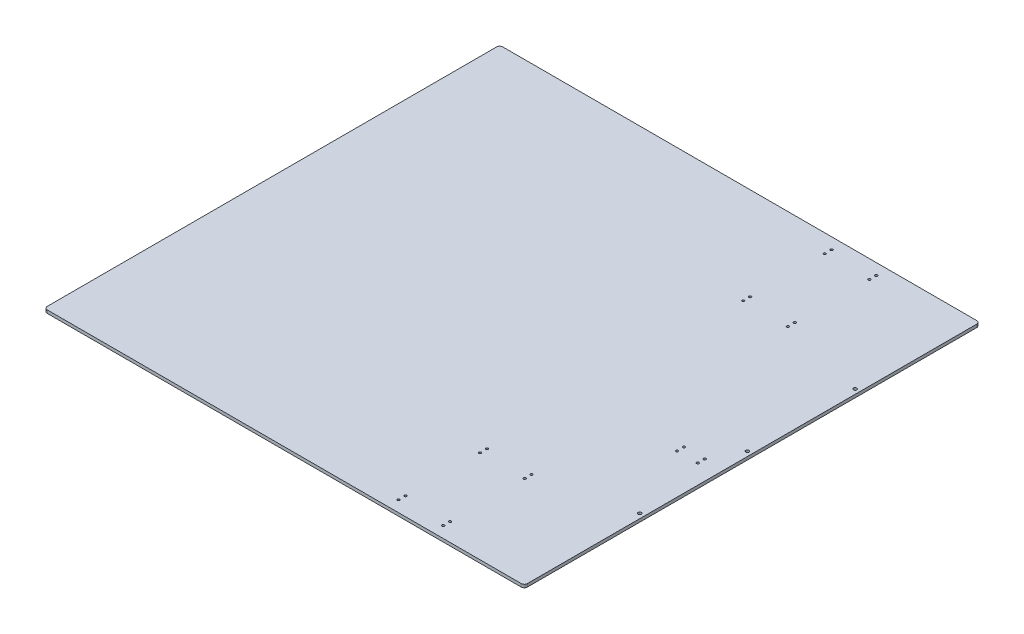
ISO-10303-21;
HEADER;
FILE_DESCRIPTION(('STEP AP214'),'2;1');
FILE_NAME('part.step','',(''),(''),'','','');
FILE_SCHEMA(('AUTOMOTIVE_DESIGN { 1 0 10303 214 1 1 1 1 }'));
ENDSEC;
DATA;
#1=APPLICATION_CONTEXT('core data for automotive mechanical design processes');
#2=APPLICATION_PROTOCOL_DEFINITION('international standard','automotive_design',2000,#1);
#3=PRODUCT_CONTEXT('',#1,'mechanical');
#4=PRODUCT('Part','Part','',(#3));
#5=PRODUCT_RELATED_PRODUCT_CATEGORY('part','',(#4));
#6=PRODUCT_DEFINITION_FORMATION('','',#4);
#7=PRODUCT_DEFINITION_CONTEXT('part definition',#1,'design');
#8=PRODUCT_DEFINITION('design','',#6,#7);
#9=PRODUCT_DEFINITION_SHAPE('','',#8);
#10=(LENGTH_UNIT() NAMED_UNIT(*) SI_UNIT(.MILLI.,.METRE.));
#11=(NAMED_UNIT(*) PLANE_ANGLE_UNIT() SI_UNIT($,.RADIAN.));
#12=(NAMED_UNIT(*) SI_UNIT($,.STERADIAN.) SOLID_ANGLE_UNIT());
#13=UNCERTAINTY_MEASURE_WITH_UNIT(LENGTH_MEASURE(1.E-05),#10,'distance_accuracy_value','');
#14=(GEOMETRIC_REPRESENTATION_CONTEXT(3) GLOBAL_UNCERTAINTY_ASSIGNED_CONTEXT((#13)) GLOBAL_UNIT_ASSIGNED_CONTEXT((#10,
#11,#12)) REPRESENTATION_CONTEXT('',''));
#15=CARTESIAN_POINT('',(0.,0.,0.));
#16=DIRECTION('',(0.,0.,1.));
#17=DIRECTION('',(1.,0.,0.));
#18=AXIS2_PLACEMENT_3D('',#15,#16,#17);
#19=CARTESIAN_POINT('',(0.,0.,469.9));
#20=DIRECTION('',(0.,1.,0.));
#21=DIRECTION('',(-1.,0.,0.));
#22=AXIS2_PLACEMENT_3D('',#19,#20,#21);
#23=PLANE('',#22);
#24=CARTESIAN_POINT('',(981.075000000002,0.,222.25));
#25=DIRECTION('',(0.,1.,0.));
#26=DIRECTION('',(0.,0.,1.));
#27=AXIS2_PLACEMENT_3D('',#24,#25,#26);
#28=CIRCLE('',#27,3.3654999999999);
#29=CARTESIAN_POINT('',(981.075000000002,0.,225.6155));
#30=VERTEX_POINT('',#29);
#31=EDGE_CURVE('E312',#30,#30,#28,.T.);
#32=ORIENTED_EDGE('',*,*,#31,.T.);
#33=EDGE_LOOP('',(#32));
#34=FACE_BOUND('',#33,.T.);
#35=CARTESIAN_POINT('',(981.074999999999,0.,-222.25));
#36=DIRECTION('',(0.,1.,0.));
#37=DIRECTION('',(0.,0.,1.));
#38=AXIS2_PLACEMENT_3D('',#35,#36,#37);
#39=CIRCLE('',#38,3.3654999999999);
#40=CARTESIAN_POINT('',(981.074999999999,0.,-218.8845));
#41=VERTEX_POINT('',#40);
#42=EDGE_CURVE('E307',#41,#41,#39,.T.);
#43=ORIENTED_EDGE('',*,*,#42,.T.);
#44=EDGE_LOOP('',(#43));
#45=FACE_BOUND('',#44,.T.);
#46=CARTESIAN_POINT('',(981.075,0.,0.));
#47=DIRECTION('',(0.,1.,0.));
#48=DIRECTION('',(0.,0.,1.));
#49=AXIS2_PLACEMENT_3D('',#46,#47,#48);
#50=CIRCLE('',#49,3.3654999999999);
#51=CARTESIAN_POINT('',(981.075,0.,3.3654999999999));
#52=VERTEX_POINT('',#51);
#53=EDGE_CURVE('E321',#52,#52,#50,.T.);
#54=ORIENTED_EDGE('',*,*,#53,.T.);
#55=EDGE_LOOP('',(#54));
#56=FACE_BOUND('',#55,.T.);
#57=CARTESIAN_POINT('',(708.025,0.,-264.414));
#58=DIRECTION('',(0.,-1.,0.));
#59=DIRECTION('',(0.,0.,-1.));
#60=AXIS2_PLACEMENT_3D('',#57,#58,#59);
#61=CIRCLE('',#60,2.4638);
#62=CARTESIAN_POINT('',(708.025,0.,-266.8778));
#63=VERTEX_POINT('',#62);
#64=EDGE_CURVE('E352',#63,#63,#61,.T.);
#65=ORIENTED_EDGE('',*,*,#64,.F.);
#66=EDGE_LOOP('',(#65));
#67=FACE_BOUND('',#66,.T.);
#68=CARTESIAN_POINT('',(800.1,0.,-432.562));
#69=DIRECTION('',(0.,-1.,0.));
#70=DIRECTION('',(0.,0.,-1.));
#71=AXIS2_PLACEMENT_3D('',#68,#69,#70);
#72=CIRCLE('',#71,2.4638);
#73=CARTESIAN_POINT('',(800.1,0.,-435.0258));
#74=VERTEX_POINT('',#73);
#75=EDGE_CURVE('E345',#74,#74,#72,.T.);
#76=ORIENTED_EDGE('',*,*,#75,.F.);
#77=EDGE_LOOP('',(#76));
#78=FACE_BOUND('',#77,.T.);
#79=CARTESIAN_POINT('',(708.025,0.,-432.562));
#80=DIRECTION('',(0.,-1.,0.));
#81=DIRECTION('',(0.,0.,-1.));
#82=AXIS2_PLACEMENT_3D('',#79,#80,#81);
#83=CIRCLE('',#82,2.4638);
#84=CARTESIAN_POINT('',(708.025,0.,-435.0258));
#85=VERTEX_POINT('',#84);
#86=EDGE_CURVE('E364',#85,#85,#83,.T.);
#87=ORIENTED_EDGE('',*,*,#86,.F.);
#88=EDGE_LOOP('',(#87));
#89=FACE_BOUND('',#88,.T.);
#90=CARTESIAN_POINT('',(708.025,0.,-446.786));
#91=DIRECTION('',(0.,-1.,0.));
#92=DIRECTION('',(0.,0.,-1.));
#93=AXIS2_PLACEMENT_3D('',#90,#91,#92);
#94=CIRCLE('',#93,2.4638);
#95=CARTESIAN_POINT('',(708.025,0.,-449.2498));
#96=VERTEX_POINT('',#95);
#97=EDGE_CURVE('E357',#96,#96,#94,.T.);
#98=ORIENTED_EDGE('',*,*,#97,.F.);
#99=EDGE_LOOP('',(#98));
#100=FACE_BOUND('',#99,.T.);
#101=CARTESIAN_POINT('',(800.1,0.,-278.638));
#102=DIRECTION('',(0.,-1.,0.));
#103=DIRECTION('',(0.,0.,-1.));
#104=AXIS2_PLACEMENT_3D('',#101,#102,#103);
#105=CIRCLE('',#104,2.4638);
#106=CARTESIAN_POINT('',(800.1,0.,-281.1018));
#107=VERTEX_POINT('',#106);
#108=EDGE_CURVE('E327',#107,#107,#105,.T.);
#109=ORIENTED_EDGE('',*,*,#108,.F.);
#110=EDGE_LOOP('',(#109));
#111=FACE_BOUND('',#110,.T.);
#112=CARTESIAN_POINT('',(800.1,0.,-264.414));
#113=DIRECTION('',(0.,-1.,0.));
#114=DIRECTION('',(0.,0.,-1.));
#115=AXIS2_PLACEMENT_3D('',#112,#113,#114);
#116=CIRCLE('',#115,2.4638);
#117=CARTESIAN_POINT('',(800.1,0.,-266.8778));
#118=VERTEX_POINT('',#117);
#119=EDGE_CURVE('E340',#118,#118,#116,.T.);
#120=ORIENTED_EDGE('',*,*,#119,.F.);
#121=EDGE_LOOP('',(#120));
#122=FACE_BOUND('',#121,.T.);
#123=CARTESIAN_POINT('',(708.025,0.,-278.638));
#124=DIRECTION('',(0.,-1.,0.));
#125=DIRECTION('',(0.,0.,-1.));
#126=AXIS2_PLACEMENT_3D('',#123,#124,#125);
#127=CIRCLE('',#126,2.4638);
#128=CARTESIAN_POINT('',(708.025,0.,-281.1018));
#129=VERTEX_POINT('',#128);
#130=EDGE_CURVE('E333',#129,#129,#127,.T.);
#131=ORIENTED_EDGE('',*,*,#130,.F.);
#132=EDGE_LOOP('',(#131));
#133=FACE_BOUND('',#132,.T.);
#134=CARTESIAN_POINT('',(800.1,0.,-446.786));
#135=DIRECTION('',(0.,-1.,0.));
#136=DIRECTION('',(0.,0.,-1.));
#137=AXIS2_PLACEMENT_3D('',#134,#135,#136);
#138=CIRCLE('',#137,2.4638);
#139=CARTESIAN_POINT('',(800.1,0.,-449.2498));
#140=VERTEX_POINT('',#139);
#141=EDGE_CURVE('E369',#140,#140,#138,.T.);
#142=ORIENTED_EDGE('',*,*,#141,.F.);
#143=EDGE_LOOP('',(#142));
#144=FACE_BOUND('',#143,.T.);
#145=CARTESIAN_POINT('',(708.025,0.,264.414));
#146=DIRECTION('',(0.,1.,0.));
#147=DIRECTION('',(0.,0.,1.));
#148=AXIS2_PLACEMENT_3D('',#145,#146,#147);
#149=CIRCLE('',#148,2.4638);
#150=CARTESIAN_POINT('',(708.025,0.,266.8778));
#151=VERTEX_POINT('',#150);
#152=EDGE_CURVE('E400',#151,#151,#149,.T.);
#153=ORIENTED_EDGE('',*,*,#152,.T.);
#154=EDGE_LOOP('',(#153));
#155=FACE_BOUND('',#154,.T.);
#156=CARTESIAN_POINT('',(800.1,0.,432.562));
#157=DIRECTION('',(0.,1.,0.));
#158=DIRECTION('',(0.,0.,1.));
#159=AXIS2_PLACEMENT_3D('',#156,#157,#158);
#160=CIRCLE('',#159,2.4638);
#161=CARTESIAN_POINT('',(800.1,0.,435.0258));
#162=VERTEX_POINT('',#161);
#163=EDGE_CURVE('E393',#162,#162,#160,.T.);
#164=ORIENTED_EDGE('',*,*,#163,.T.);
#165=EDGE_LOOP('',(#164));
#166=FACE_BOUND('',#165,.T.);
#167=CARTESIAN_POINT('',(708.025,0.,432.562));
#168=DIRECTION('',(0.,1.,0.));
#169=DIRECTION('',(0.,0.,1.));
#170=AXIS2_PLACEMENT_3D('',#167,#168,#169);
#171=CIRCLE('',#170,2.4638);
#172=CARTESIAN_POINT('',(708.025,0.,435.0258));
#173=VERTEX_POINT('',#172);
#174=EDGE_CURVE('E412',#173,#173,#171,.T.);
#175=ORIENTED_EDGE('',*,*,#174,.T.);
#176=EDGE_LOOP('',(#175));
#177=FACE_BOUND('',#176,.T.);
#178=CARTESIAN_POINT('',(708.025,0.,446.786));
#179=DIRECTION('',(0.,1.,0.));
#180=DIRECTION('',(0.,0.,1.));
#181=AXIS2_PLACEMENT_3D('',#178,#179,#180);
#182=CIRCLE('',#181,2.4638);
#183=CARTESIAN_POINT('',(708.025,0.,449.2498));
#184=VERTEX_POINT('',#183);
#185=EDGE_CURVE('E405',#184,#184,#182,.T.);
#186=ORIENTED_EDGE('',*,*,#185,.T.);
#187=EDGE_LOOP('',(#186));
#188=FACE_BOUND('',#187,.T.);
#189=CARTESIAN_POINT('',(800.1,0.,278.638));
#190=DIRECTION('',(0.,1.,0.));
#191=DIRECTION('',(0.,0.,1.));
#192=AXIS2_PLACEMENT_3D('',#189,#190,#191);
#193=CIRCLE('',#192,2.4638);
#194=CARTESIAN_POINT('',(800.1,0.,281.1018));
#195=VERTEX_POINT('',#194);
#196=EDGE_CURVE('E375',#195,#195,#193,.T.);
#197=ORIENTED_EDGE('',*,*,#196,.T.);
#198=EDGE_LOOP('',(#197));
#199=FACE_BOUND('',#198,.T.);
#200=CARTESIAN_POINT('',(800.1,0.,264.414));
#201=DIRECTION('',(0.,1.,0.));
#202=DIRECTION('',(0.,0.,1.));
#203=AXIS2_PLACEMENT_3D('',#200,#201,#202);
#204=CIRCLE('',#203,2.4638);
#205=CARTESIAN_POINT('',(800.1,0.,266.8778));
#206=VERTEX_POINT('',#205);
#207=EDGE_CURVE('E388',#206,#206,#204,.T.);
#208=ORIENTED_EDGE('',*,*,#207,.T.);
#209=EDGE_LOOP('',(#208));
#210=FACE_BOUND('',#209,.T.);
#211=CARTESIAN_POINT('',(708.025,0.,278.638));
#212=DIRECTION('',(0.,1.,0.));
#213=DIRECTION('',(0.,0.,1.));
#214=AXIS2_PLACEMENT_3D('',#211,#212,#213);
#215=CIRCLE('',#214,2.4638);
#216=CARTESIAN_POINT('',(708.025,0.,281.1018));
#217=VERTEX_POINT('',#216);
#218=EDGE_CURVE('E381',#217,#217,#215,.T.);
#219=ORIENTED_EDGE('',*,*,#218,.T.);
#220=EDGE_LOOP('',(#219));
#221=FACE_BOUND('',#220,.T.);
#222=CARTESIAN_POINT('',(800.1,0.,446.786));
#223=DIRECTION('',(0.,1.,0.));
#224=DIRECTION('',(0.,0.,1.));
#225=AXIS2_PLACEMENT_3D('',#222,#223,#224);
#226=CIRCLE('',#225,2.4638);
#227=CARTESIAN_POINT('',(800.1,0.,449.2498));
#228=VERTEX_POINT('',#227);
#229=EDGE_CURVE('E417',#228,#228,#226,.T.);
#230=ORIENTED_EDGE('',*,*,#229,.T.);
#231=EDGE_LOOP('',(#230));
#232=FACE_BOUND('',#231,.T.);
#233=CARTESIAN_POINT('',(908.05,0.,58.039));
#234=DIRECTION('',(0.,1.,0.));
#235=DIRECTION('',(0.,0.,1.));
#236=AXIS2_PLACEMENT_3D('',#233,#234,#235);
#237=CIRCLE('',#236,2.4638);
#238=CARTESIAN_POINT('',(908.05,0.,60.5028));
#239=VERTEX_POINT('',#238);
#240=EDGE_CURVE('E429',#239,#239,#237,.T.);
#241=ORIENTED_EDGE('',*,*,#240,.T.);
#242=EDGE_LOOP('',(#241));
#243=FACE_BOUND('',#242,.T.);
#244=CARTESIAN_POINT('',(950.976,0.,72.263));
#245=DIRECTION('',(0.,1.,0.));
#246=DIRECTION('',(0.,0.,1.));
#247=AXIS2_PLACEMENT_3D('',#244,#245,#246);
#248=CIRCLE('',#247,2.4638);
#249=CARTESIAN_POINT('',(950.976,0.,74.7268));
#250=VERTEX_POINT('',#249);
#251=EDGE_CURVE('E436',#250,#250,#248,.T.);
#252=ORIENTED_EDGE('',*,*,#251,.T.);
#253=EDGE_LOOP('',(#252));
#254=FACE_BOUND('',#253,.T.);
#255=CARTESIAN_POINT('',(950.976,0.,58.039));
#256=DIRECTION('',(0.,1.,0.));
#257=DIRECTION('',(0.,0.,1.));
#258=AXIS2_PLACEMENT_3D('',#255,#256,#257);
#259=CIRCLE('',#258,2.4638);
#260=CARTESIAN_POINT('',(950.976,0.,60.5028));
#261=VERTEX_POINT('',#260);
#262=EDGE_CURVE('E423',#261,#261,#259,.T.);
#263=ORIENTED_EDGE('',*,*,#262,.T.);
#264=EDGE_LOOP('',(#263));
#265=FACE_BOUND('',#264,.T.);
#266=CARTESIAN_POINT('',(908.05,0.,72.263));
#267=DIRECTION('',(0.,1.,0.));
#268=DIRECTION('',(0.,0.,1.));
#269=AXIS2_PLACEMENT_3D('',#266,#267,#268);
#270=CIRCLE('',#269,2.4638);
#271=CARTESIAN_POINT('',(908.05,0.,74.7268));
#272=VERTEX_POINT('',#271);
#273=EDGE_CURVE('E164',#272,#272,#270,.T.);
#274=ORIENTED_EDGE('',*,*,#273,.T.);
#275=EDGE_LOOP('',(#274));
#276=FACE_BOUND('',#275,.T.);
#277=DIRECTION('',(0.,0.,-1.));
#278=VECTOR('',#277,1.);
#279=CARTESIAN_POINT('',(0.,0.,469.9));
#280=LINE('',#279,#278);
#281=CARTESIAN_POINT('',(0.,0.,463.55));
#282=VERTEX_POINT('',#281);
#283=CARTESIAN_POINT('',(0.,0.,-463.55));
#284=VERTEX_POINT('',#283);
#285=EDGE_CURVE('E105',#282,#284,#280,.T.);
#286=ORIENTED_EDGE('',*,*,#285,.T.);
#287=CARTESIAN_POINT('',(6.35,0.,-463.55));
#288=DIRECTION('',(0.,1.,0.));
#289=DIRECTION('',(-1.,0.,0.));
#290=AXIS2_PLACEMENT_3D('',#287,#288,#289);
#291=CIRCLE('',#290,6.35);
#292=CARTESIAN_POINT('',(6.35,0.,-469.9));
#293=VERTEX_POINT('',#292);
#294=EDGE_CURVE('E138',#284,#293,#291,.F.);
#295=ORIENTED_EDGE('',*,*,#294,.T.);
#296=DIRECTION('',(1.,0.,0.));
#297=VECTOR('',#296,1.);
#298=CARTESIAN_POINT('',(0.,0.,-469.9));
#299=LINE('',#298,#297);
#300=CARTESIAN_POINT('',(984.25,0.,-469.9));
#301=VERTEX_POINT('',#300);
#302=EDGE_CURVE('E161',#293,#301,#299,.T.);
#303=ORIENTED_EDGE('',*,*,#302,.T.);
#304=CARTESIAN_POINT('',(984.25,0.,-463.55));
#305=DIRECTION('',(0.,1.,0.));
#306=DIRECTION('',(-1.,0.,0.));
#307=AXIS2_PLACEMENT_3D('',#304,#305,#306);
#308=CIRCLE('',#307,6.35);
#309=CARTESIAN_POINT('',(990.6,0.,-463.55));
#310=VERTEX_POINT('',#309);
#311=EDGE_CURVE('E136',#301,#310,#308,.F.);
#312=ORIENTED_EDGE('',*,*,#311,.T.);
#313=DIRECTION('',(0.,0.,-1.));
#314=VECTOR('',#313,1.);
#315=CARTESIAN_POINT('',(990.6,0.,469.9));
#316=LINE('',#315,#314);
#317=CARTESIAN_POINT('',(990.6,0.,463.55));
#318=VERTEX_POINT('',#317);
#319=EDGE_CURVE('E127',#318,#310,#316,.T.);
#320=ORIENTED_EDGE('',*,*,#319,.F.);
#321=CARTESIAN_POINT('',(984.25,0.,463.55));
#322=DIRECTION('',(0.,1.,0.));
#323=DIRECTION('',(-1.,0.,0.));
#324=AXIS2_PLACEMENT_3D('',#321,#322,#323);
#325=CIRCLE('',#324,6.35);
#326=CARTESIAN_POINT('',(984.25,0.,469.9));
#327=VERTEX_POINT('',#326);
#328=EDGE_CURVE('E112',#318,#327,#325,.F.);
#329=ORIENTED_EDGE('',*,*,#328,.T.);
#330=DIRECTION('',(1.,0.,0.));
#331=VECTOR('',#330,1.);
#332=CARTESIAN_POINT('',(0.,0.,469.9));
#333=LINE('',#332,#331);
#334=CARTESIAN_POINT('',(6.35,0.,469.9));
#335=VERTEX_POINT('',#334);
#336=EDGE_CURVE('E107',#335,#327,#333,.T.);
#337=ORIENTED_EDGE('',*,*,#336,.F.);
#338=CARTESIAN_POINT('',(6.35,0.,463.55));
#339=DIRECTION('',(0.,1.,0.));
#340=DIRECTION('',(-1.,0.,0.));
#341=AXIS2_PLACEMENT_3D('',#338,#339,#340);
#342=CIRCLE('',#341,6.35);
#343=EDGE_CURVE('E103',#335,#282,#342,.F.);
#344=ORIENTED_EDGE('',*,*,#343,.T.);
#345=EDGE_LOOP('',(#286,#295,#303,#312,#320,#329,#337,#344));
#346=FACE_BOUND('',#345,.T.);
#347=ADVANCED_FACE('F36',(#34,#45,#56,#67,#78,#89,#100,#111,#122,#133,#144,#155,#166,#177,#188,
#199,#210,#221,#232,#243,#254,#265,#276,#346),#23,.F.);
#348=CARTESIAN_POINT('',(990.6,0.,469.9));
#349=DIRECTION('',(-1.,0.,0.));
#350=DIRECTION('',(0.,0.,1.));
#351=AXIS2_PLACEMENT_3D('',#348,#349,#350);
#352=PLANE('',#351);
#353=ORIENTED_EDGE('',*,*,#319,.T.);
#354=DIRECTION('',(0.,1.,0.));
#355=VECTOR('',#354,1.);
#356=CARTESIAN_POINT('',(990.6,0.,-463.55));
#357=LINE('',#356,#355);
#358=CARTESIAN_POINT('',(990.6,6.35,-463.55));
#359=VERTEX_POINT('',#358);
#360=EDGE_CURVE('E151',#310,#359,#357,.T.);
#361=ORIENTED_EDGE('',*,*,#360,.T.);
#362=DIRECTION('',(0.,0.,-1.));
#363=VECTOR('',#362,1.);
#364=CARTESIAN_POINT('',(990.6,6.35,469.9));
#365=LINE('',#364,#363);
#366=CARTESIAN_POINT('',(990.6,6.35,463.55));
#367=VERTEX_POINT('',#366);
#368=EDGE_CURVE('E131',#367,#359,#365,.T.);
#369=ORIENTED_EDGE('',*,*,#368,.F.);
#370=DIRECTION('',(0.,1.,0.));
#371=VECTOR('',#370,1.);
#372=CARTESIAN_POINT('',(990.6,0.,463.55));
#373=LINE('',#372,#371);
#374=EDGE_CURVE('E149',#367,#318,#373,.F.);
#375=ORIENTED_EDGE('',*,*,#374,.T.);
#376=EDGE_LOOP('',(#353,#361,#369,#375));
#377=FACE_BOUND('',#376,.T.);
#378=ADVANCED_FACE('F171',(#377),#352,.F.);
#379=CARTESIAN_POINT('',(0.,6.34999999999997,469.9));
#380=DIRECTION('',(0.,-1.,0.));
#381=DIRECTION('',(1.,0.,0.));
#382=AXIS2_PLACEMENT_3D('',#379,#380,#381);
#383=PLANE('',#382);
#384=CARTESIAN_POINT('',(981.075000000002,6.34999999999997,222.25));
#385=DIRECTION('',(0.,1.,0.));
#386=DIRECTION('',(0.,0.,1.));
#387=AXIS2_PLACEMENT_3D('',#384,#385,#386);
#388=CIRCLE('',#387,3.3654999999999);
#389=CARTESIAN_POINT('',(981.075000000002,6.34999999999997,225.6155));
#390=VERTEX_POINT('',#389);
#391=EDGE_CURVE('E316',#390,#390,#388,.T.);
#392=ORIENTED_EDGE('',*,*,#391,.F.);
#393=EDGE_LOOP('',(#392));
#394=FACE_BOUND('',#393,.T.);
#395=CARTESIAN_POINT('',(981.074999999999,6.34999999999997,-222.25));
#396=DIRECTION('',(0.,1.,0.));
#397=DIRECTION('',(0.,0.,1.));
#398=AXIS2_PLACEMENT_3D('',#395,#396,#397);
#399=CIRCLE('',#398,3.3654999999999);
#400=CARTESIAN_POINT('',(981.074999999999,6.34999999999997,-218.8845));
#401=VERTEX_POINT('',#400);
#402=EDGE_CURVE('E310',#401,#401,#399,.T.);
#403=ORIENTED_EDGE('',*,*,#402,.F.);
#404=EDGE_LOOP('',(#403));
#405=FACE_BOUND('',#404,.T.);
#406=CARTESIAN_POINT('',(981.075,6.34999999999997,0.));
#407=DIRECTION('',(0.,1.,0.));
#408=DIRECTION('',(0.,0.,1.));
#409=AXIS2_PLACEMENT_3D('',#406,#407,#408);
#410=CIRCLE('',#409,3.3654999999999);
#411=CARTESIAN_POINT('',(981.075,6.34999999999997,3.3654999999999));
#412=VERTEX_POINT('',#411);
#413=EDGE_CURVE('E314',#412,#412,#410,.T.);
#414=ORIENTED_EDGE('',*,*,#413,.F.);
#415=EDGE_LOOP('',(#414));
#416=FACE_BOUND('',#415,.T.);
#417=CARTESIAN_POINT('',(708.025,6.34999999999997,-264.414));
#418=DIRECTION('',(0.,-1.,0.));
#419=DIRECTION('',(0.,0.,-1.));
#420=AXIS2_PLACEMENT_3D('',#417,#418,#419);
#421=CIRCLE('',#420,2.4638);
#422=CARTESIAN_POINT('',(708.025,6.34999999999997,-266.8778));
#423=VERTEX_POINT('',#422);
#424=EDGE_CURVE('E336',#423,#423,#421,.T.);
#425=ORIENTED_EDGE('',*,*,#424,.T.);
#426=EDGE_LOOP('',(#425));
#427=FACE_BOUND('',#426,.T.);
#428=CARTESIAN_POINT('',(800.1,6.34999999999997,-432.562));
#429=DIRECTION('',(0.,-1.,0.));
#430=DIRECTION('',(0.,0.,-1.));
#431=AXIS2_PLACEMENT_3D('',#428,#429,#430);
#432=CIRCLE('',#431,2.4638);
#433=CARTESIAN_POINT('',(800.1,6.34999999999997,-435.0258));
#434=VERTEX_POINT('',#433);
#435=EDGE_CURVE('E349',#434,#434,#432,.T.);
#436=ORIENTED_EDGE('',*,*,#435,.T.);
#437=EDGE_LOOP('',(#436));
#438=FACE_BOUND('',#437,.T.);
#439=CARTESIAN_POINT('',(708.025,6.34999999999997,-432.562));
#440=DIRECTION('',(0.,-1.,0.));
#441=DIRECTION('',(0.,0.,-1.));
#442=AXIS2_PLACEMENT_3D('',#439,#440,#441);
#443=CIRCLE('',#442,2.4638);
#444=CARTESIAN_POINT('',(708.025,6.34999999999997,-435.0258));
#445=VERTEX_POINT('',#444);
#446=EDGE_CURVE('E348',#445,#445,#443,.T.);
#447=ORIENTED_EDGE('',*,*,#446,.T.);
#448=EDGE_LOOP('',(#447));
#449=FACE_BOUND('',#448,.T.);
#450=CARTESIAN_POINT('',(708.025,6.34999999999997,-446.786));
#451=DIRECTION('',(0.,-1.,0.));
#452=DIRECTION('',(0.,0.,-1.));
#453=AXIS2_PLACEMENT_3D('',#450,#451,#452);
#454=CIRCLE('',#453,2.4638);
#455=CARTESIAN_POINT('',(708.025,6.34999999999997,-449.2498));
#456=VERTEX_POINT('',#455);
#457=EDGE_CURVE('E361',#456,#456,#454,.T.);
#458=ORIENTED_EDGE('',*,*,#457,.T.);
#459=EDGE_LOOP('',(#458));
#460=FACE_BOUND('',#459,.T.);
#461=CARTESIAN_POINT('',(800.1,6.34999999999997,-278.638));
#462=DIRECTION('',(0.,-1.,0.));
#463=DIRECTION('',(0.,0.,-1.));
#464=AXIS2_PLACEMENT_3D('',#461,#462,#463);
#465=CIRCLE('',#464,2.4638);
#466=CARTESIAN_POINT('',(800.1,6.34999999999997,-281.1018));
#467=VERTEX_POINT('',#466);
#468=EDGE_CURVE('E324',#467,#467,#465,.T.);
#469=ORIENTED_EDGE('',*,*,#468,.T.);
#470=EDGE_LOOP('',(#469));
#471=FACE_BOUND('',#470,.T.);
#472=CARTESIAN_POINT('',(800.1,6.34999999999997,-264.414));
#473=DIRECTION('',(0.,-1.,0.));
#474=DIRECTION('',(0.,0.,-1.));
#475=AXIS2_PLACEMENT_3D('',#472,#473,#474);
#476=CIRCLE('',#475,2.4638);
#477=CARTESIAN_POINT('',(800.1,6.34999999999997,-266.8778));
#478=VERTEX_POINT('',#477);
#479=EDGE_CURVE('E330',#478,#478,#476,.T.);
#480=ORIENTED_EDGE('',*,*,#479,.T.);
#481=EDGE_LOOP('',(#480));
#482=FACE_BOUND('',#481,.T.);
#483=CARTESIAN_POINT('',(708.025,6.34999999999997,-278.638));
#484=DIRECTION('',(0.,-1.,0.));
#485=DIRECTION('',(0.,0.,-1.));
#486=AXIS2_PLACEMENT_3D('',#483,#484,#485);
#487=CIRCLE('',#486,2.4638);
#488=CARTESIAN_POINT('',(708.025,6.34999999999997,-281.1018));
#489=VERTEX_POINT('',#488);
#490=EDGE_CURVE('E337',#489,#489,#487,.T.);
#491=ORIENTED_EDGE('',*,*,#490,.T.);
#492=EDGE_LOOP('',(#491));
#493=FACE_BOUND('',#492,.T.);
#494=CARTESIAN_POINT('',(800.1,6.34999999999997,-446.786));
#495=DIRECTION('',(0.,-1.,0.));
#496=DIRECTION('',(0.,0.,-1.));
#497=AXIS2_PLACEMENT_3D('',#494,#495,#496);
#498=CIRCLE('',#497,2.4638);
#499=CARTESIAN_POINT('',(800.1,6.34999999999997,-449.2498));
#500=VERTEX_POINT('',#499);
#501=EDGE_CURVE('E360',#500,#500,#498,.T.);
#502=ORIENTED_EDGE('',*,*,#501,.T.);
#503=EDGE_LOOP('',(#502));
#504=FACE_BOUND('',#503,.T.);
#505=CARTESIAN_POINT('',(708.025,6.34999999999997,264.414));
#506=DIRECTION('',(0.,1.,0.));
#507=DIRECTION('',(0.,0.,1.));
#508=AXIS2_PLACEMENT_3D('',#505,#506,#507);
#509=CIRCLE('',#508,2.4638);
#510=CARTESIAN_POINT('',(708.025,6.34999999999997,266.8778));
#511=VERTEX_POINT('',#510);
#512=EDGE_CURVE('E384',#511,#511,#509,.T.);
#513=ORIENTED_EDGE('',*,*,#512,.F.);
#514=EDGE_LOOP('',(#513));
#515=FACE_BOUND('',#514,.T.);
#516=CARTESIAN_POINT('',(800.1,6.34999999999997,432.562));
#517=DIRECTION('',(0.,1.,0.));
#518=DIRECTION('',(0.,0.,1.));
#519=AXIS2_PLACEMENT_3D('',#516,#517,#518);
#520=CIRCLE('',#519,2.4638);
#521=CARTESIAN_POINT('',(800.1,6.34999999999997,435.0258));
#522=VERTEX_POINT('',#521);
#523=EDGE_CURVE('E397',#522,#522,#520,.T.);
#524=ORIENTED_EDGE('',*,*,#523,.F.);
#525=EDGE_LOOP('',(#524));
#526=FACE_BOUND('',#525,.T.);
#527=CARTESIAN_POINT('',(708.025,6.34999999999997,432.562));
#528=DIRECTION('',(0.,1.,0.));
#529=DIRECTION('',(0.,0.,1.));
#530=AXIS2_PLACEMENT_3D('',#527,#528,#529);
#531=CIRCLE('',#530,2.4638);
#532=CARTESIAN_POINT('',(708.025,6.34999999999997,435.0258));
#533=VERTEX_POINT('',#532);
#534=EDGE_CURVE('E396',#533,#533,#531,.T.);
#535=ORIENTED_EDGE('',*,*,#534,.F.);
#536=EDGE_LOOP('',(#535));
#537=FACE_BOUND('',#536,.T.);
#538=CARTESIAN_POINT('',(708.025,6.34999999999997,446.786));
#539=DIRECTION('',(0.,1.,0.));
#540=DIRECTION('',(0.,0.,1.));
#541=AXIS2_PLACEMENT_3D('',#538,#539,#540);
#542=CIRCLE('',#541,2.4638);
#543=CARTESIAN_POINT('',(708.025,6.34999999999997,449.2498));
#544=VERTEX_POINT('',#543);
#545=EDGE_CURVE('E409',#544,#544,#542,.T.);
#546=ORIENTED_EDGE('',*,*,#545,.F.);
#547=EDGE_LOOP('',(#546));
#548=FACE_BOUND('',#547,.T.);
#549=CARTESIAN_POINT('',(800.1,6.34999999999997,278.638));
#550=DIRECTION('',(0.,1.,0.));
#551=DIRECTION('',(0.,0.,1.));
#552=AXIS2_PLACEMENT_3D('',#549,#550,#551);
#553=CIRCLE('',#552,2.4638);
#554=CARTESIAN_POINT('',(800.1,6.34999999999997,281.1018));
#555=VERTEX_POINT('',#554);
#556=EDGE_CURVE('E372',#555,#555,#553,.T.);
#557=ORIENTED_EDGE('',*,*,#556,.F.);
#558=EDGE_LOOP('',(#557));
#559=FACE_BOUND('',#558,.T.);
#560=CARTESIAN_POINT('',(800.1,6.34999999999997,264.414));
#561=DIRECTION('',(0.,1.,0.));
#562=DIRECTION('',(0.,0.,1.));
#563=AXIS2_PLACEMENT_3D('',#560,#561,#562);
#564=CIRCLE('',#563,2.4638);
#565=CARTESIAN_POINT('',(800.1,6.34999999999997,266.8778));
#566=VERTEX_POINT('',#565);
#567=EDGE_CURVE('E378',#566,#566,#564,.T.);
#568=ORIENTED_EDGE('',*,*,#567,.F.);
#569=EDGE_LOOP('',(#568));
#570=FACE_BOUND('',#569,.T.);
#571=CARTESIAN_POINT('',(708.025,6.34999999999997,278.638));
#572=DIRECTION('',(0.,1.,0.));
#573=DIRECTION('',(0.,0.,1.));
#574=AXIS2_PLACEMENT_3D('',#571,#572,#573);
#575=CIRCLE('',#574,2.4638);
#576=CARTESIAN_POINT('',(708.025,6.34999999999997,281.1018));
#577=VERTEX_POINT('',#576);
#578=EDGE_CURVE('E385',#577,#577,#575,.T.);
#579=ORIENTED_EDGE('',*,*,#578,.F.);
#580=EDGE_LOOP('',(#579));
#581=FACE_BOUND('',#580,.T.);
#582=CARTESIAN_POINT('',(800.1,6.34999999999997,446.786));
#583=DIRECTION('',(0.,1.,0.));
#584=DIRECTION('',(0.,0.,1.));
#585=AXIS2_PLACEMENT_3D('',#582,#583,#584);
#586=CIRCLE('',#585,2.4638);
#587=CARTESIAN_POINT('',(800.1,6.34999999999997,449.2498));
#588=VERTEX_POINT('',#587);
#589=EDGE_CURVE('E408',#588,#588,#586,.T.);
#590=ORIENTED_EDGE('',*,*,#589,.F.);
#591=EDGE_LOOP('',(#590));
#592=FACE_BOUND('',#591,.T.);
#593=CARTESIAN_POINT('',(908.05,6.34999999999997,58.039));
#594=DIRECTION('',(0.,1.,0.));
#595=DIRECTION('',(0.,0.,1.));
#596=AXIS2_PLACEMENT_3D('',#593,#594,#595);
#597=CIRCLE('',#596,2.4638);
#598=CARTESIAN_POINT('',(908.05,6.34999999999997,60.5028));
#599=VERTEX_POINT('',#598);
#600=EDGE_CURVE('E433',#599,#599,#597,.T.);
#601=ORIENTED_EDGE('',*,*,#600,.F.);
#602=EDGE_LOOP('',(#601));
#603=FACE_BOUND('',#602,.T.);
#604=CARTESIAN_POINT('',(950.976,6.34999999999997,72.263));
#605=DIRECTION('',(0.,1.,0.));
#606=DIRECTION('',(0.,0.,1.));
#607=AXIS2_PLACEMENT_3D('',#604,#605,#606);
#608=CIRCLE('',#607,2.4638);
#609=CARTESIAN_POINT('',(950.976,6.34999999999997,74.7268));
#610=VERTEX_POINT('',#609);
#611=EDGE_CURVE('E426',#610,#610,#608,.T.);
#612=ORIENTED_EDGE('',*,*,#611,.F.);
#613=EDGE_LOOP('',(#612));
#614=FACE_BOUND('',#613,.T.);
#615=CARTESIAN_POINT('',(950.976,6.34999999999997,58.039));
#616=DIRECTION('',(0.,1.,0.));
#617=DIRECTION('',(0.,0.,1.));
#618=AXIS2_PLACEMENT_3D('',#615,#616,#617);
#619=CIRCLE('',#618,2.4638);
#620=CARTESIAN_POINT('',(950.976,6.34999999999997,60.5028));
#621=VERTEX_POINT('',#620);
#622=EDGE_CURVE('E420',#621,#621,#619,.T.);
#623=ORIENTED_EDGE('',*,*,#622,.F.);
#624=EDGE_LOOP('',(#623));
#625=FACE_BOUND('',#624,.T.);
#626=CARTESIAN_POINT('',(908.05,6.34999999999997,72.263));
#627=DIRECTION('',(0.,1.,0.));
#628=DIRECTION('',(0.,0.,1.));
#629=AXIS2_PLACEMENT_3D('',#626,#627,#628);
#630=CIRCLE('',#629,2.4638);
#631=CARTESIAN_POINT('',(908.05,6.34999999999997,74.7268));
#632=VERTEX_POINT('',#631);
#633=EDGE_CURVE('E432',#632,#632,#630,.T.);
#634=ORIENTED_EDGE('',*,*,#633,.F.);
#635=EDGE_LOOP('',(#634));
#636=FACE_BOUND('',#635,.T.);
#637=DIRECTION('',(-1.,0.,0.));
#638=VECTOR('',#637,1.);
#639=CARTESIAN_POINT('',(0.,6.34999999999997,-469.9));
#640=LINE('',#639,#638);
#641=CARTESIAN_POINT('',(984.25,6.35,-469.9));
#642=VERTEX_POINT('',#641);
#643=CARTESIAN_POINT('',(6.35,6.34999999999997,-469.9));
#644=VERTEX_POINT('',#643);
#645=EDGE_CURVE('E157',#642,#644,#640,.T.);
#646=ORIENTED_EDGE('',*,*,#645,.T.);
#647=CARTESIAN_POINT('',(6.35,6.34999999999997,-463.55));
#648=DIRECTION('',(0.,-1.,0.));
#649=DIRECTION('',(1.,0.,0.));
#650=AXIS2_PLACEMENT_3D('',#647,#648,#649);
#651=CIRCLE('',#650,6.35);
#652=CARTESIAN_POINT('',(0.,6.34999999999997,-463.55));
#653=VERTEX_POINT('',#652);
#654=EDGE_CURVE('E147',#644,#653,#651,.F.);
#655=ORIENTED_EDGE('',*,*,#654,.T.);
#656=DIRECTION('',(0.,0.,-1.));
#657=VECTOR('',#656,1.);
#658=CARTESIAN_POINT('',(0.,6.34999999999997,469.9));
#659=LINE('',#658,#657);
#660=CARTESIAN_POINT('',(0.,6.34999999999997,463.55));
#661=VERTEX_POINT('',#660);
#662=EDGE_CURVE('E122',#661,#653,#659,.T.);
#663=ORIENTED_EDGE('',*,*,#662,.F.);
#664=CARTESIAN_POINT('',(6.35,6.34999999999997,463.55));
#665=DIRECTION('',(0.,-1.,0.));
#666=DIRECTION('',(1.,0.,0.));
#667=AXIS2_PLACEMENT_3D('',#664,#665,#666);
#668=CIRCLE('',#667,6.35);
#669=CARTESIAN_POINT('',(6.35,6.34999999999997,469.9));
#670=VERTEX_POINT('',#669);
#671=EDGE_CURVE('E126',#661,#670,#668,.F.);
#672=ORIENTED_EDGE('',*,*,#671,.T.);
#673=DIRECTION('',(-1.,0.,0.));
#674=VECTOR('',#673,1.);
#675=CARTESIAN_POINT('',(0.,6.34999999999997,469.9));
#676=LINE('',#675,#674);
#677=CARTESIAN_POINT('',(984.25,6.35,469.9));
#678=VERTEX_POINT('',#677);
#679=EDGE_CURVE('E123',#678,#670,#676,.T.);
#680=ORIENTED_EDGE('',*,*,#679,.F.);
#681=CARTESIAN_POINT('',(984.25,6.35,463.55));
#682=DIRECTION('',(0.,-1.,0.));
#683=DIRECTION('',(1.,0.,0.));
#684=AXIS2_PLACEMENT_3D('',#681,#682,#683);
#685=CIRCLE('',#684,6.35);
#686=EDGE_CURVE('E59',#678,#367,#685,.F.);
#687=ORIENTED_EDGE('',*,*,#686,.T.);
#688=ORIENTED_EDGE('',*,*,#368,.T.);
#689=CARTESIAN_POINT('',(984.25,6.35,-463.55));
#690=DIRECTION('',(0.,-1.,0.));
#691=DIRECTION('',(1.,0.,0.));
#692=AXIS2_PLACEMENT_3D('',#689,#690,#691);
#693=CIRCLE('',#692,6.35);
#694=EDGE_CURVE('E51',#359,#642,#693,.F.);
#695=ORIENTED_EDGE('',*,*,#694,.T.);
#696=EDGE_LOOP('',(#646,#655,#663,#672,#680,#687,#688,#695));
#697=FACE_BOUND('',#696,.T.);
#698=ADVANCED_FACE('F167',(#394,#405,#416,#427,#438,#449,#460,#471,#482,#493,#504,#515,#526,
#537,#548,#559,#570,#581,#592,#603,#614,#625,#636,#697),#383,.F.);
#699=CARTESIAN_POINT('',(0.,0.,469.9));
#700=DIRECTION('',(1.,0.,0.));
#701=DIRECTION('',(0.,0.,-1.));
#702=AXIS2_PLACEMENT_3D('',#699,#700,#701);
#703=PLANE('',#702);
#704=ORIENTED_EDGE('',*,*,#662,.T.);
#705=DIRECTION('',(0.,-1.,0.));
#706=VECTOR('',#705,1.);
#707=CARTESIAN_POINT('',(0.,0.,-463.55));
#708=LINE('',#707,#706);
#709=EDGE_CURVE('E113',#653,#284,#708,.T.);
#710=ORIENTED_EDGE('',*,*,#709,.T.);
#711=ORIENTED_EDGE('',*,*,#285,.F.);
#712=DIRECTION('',(0.,-1.,0.));
#713=VECTOR('',#712,1.);
#714=CARTESIAN_POINT('',(0.,6.34999999999997,463.55));
#715=LINE('',#714,#713);
#716=EDGE_CURVE('E119',#282,#661,#715,.F.);
#717=ORIENTED_EDGE('',*,*,#716,.T.);
#718=EDGE_LOOP('',(#704,#710,#711,#717));
#719=FACE_BOUND('',#718,.T.);
#720=ADVANCED_FACE('F118',(#719),#703,.F.);
#721=CARTESIAN_POINT('',(0.,0.,469.9));
#722=DIRECTION('',(0.,0.,1.));
#723=DIRECTION('',(1.,0.,0.));
#724=AXIS2_PLACEMENT_3D('',#721,#722,#723);
#725=PLANE('',#724);
#726=ORIENTED_EDGE('',*,*,#336,.T.);
#727=DIRECTION('',(0.,1.,0.));
#728=VECTOR('',#727,1.);
#729=CARTESIAN_POINT('',(984.25,6.35,469.9));
#730=LINE('',#729,#728);
#731=EDGE_CURVE('E11',#327,#678,#730,.T.);
#732=ORIENTED_EDGE('',*,*,#731,.T.);
#733=ORIENTED_EDGE('',*,*,#679,.T.);
#734=DIRECTION('',(0.,-1.,0.));
#735=VECTOR('',#734,1.);
#736=CARTESIAN_POINT('',(6.35,0.,469.9));
#737=LINE('',#736,#735);
#738=EDGE_CURVE('E44',#670,#335,#737,.T.);
#739=ORIENTED_EDGE('',*,*,#738,.T.);
#740=EDGE_LOOP('',(#726,#732,#733,#739));
#741=FACE_BOUND('',#740,.T.);
#742=ADVANCED_FACE('F154',(#741),#725,.T.);
#743=CARTESIAN_POINT('',(0.,0.,-469.9));
#744=DIRECTION('',(0.,0.,1.));
#745=DIRECTION('',(1.,0.,0.));
#746=AXIS2_PLACEMENT_3D('',#743,#744,#745);
#747=PLANE('',#746);
#748=ORIENTED_EDGE('',*,*,#302,.F.);
#749=DIRECTION('',(0.,-1.,0.));
#750=VECTOR('',#749,1.);
#751=CARTESIAN_POINT('',(6.35,0.,-469.9));
#752=LINE('',#751,#750);
#753=EDGE_CURVE('E142',#293,#644,#752,.F.);
#754=ORIENTED_EDGE('',*,*,#753,.T.);
#755=ORIENTED_EDGE('',*,*,#645,.F.);
#756=DIRECTION('',(0.,1.,0.));
#757=VECTOR('',#756,1.);
#758=CARTESIAN_POINT('',(984.25,0.,-469.9));
#759=LINE('',#758,#757);
#760=EDGE_CURVE('E140',#642,#301,#759,.F.);
#761=ORIENTED_EDGE('',*,*,#760,.T.);
#762=EDGE_LOOP('',(#748,#754,#755,#761));
#763=FACE_BOUND('',#762,.T.);
#764=ADVANCED_FACE('F180',(#763),#747,.F.);
#765=CARTESIAN_POINT('',(908.05,0.,72.263));
#766=DIRECTION('',(0.,1.,0.));
#767=DIRECTION('',(0.,0.,1.));
#768=AXIS2_PLACEMENT_3D('',#765,#766,#767);
#769=CYLINDRICAL_SURFACE('',#768,2.4638);
#770=ORIENTED_EDGE('',*,*,#273,.F.);
#771=EDGE_LOOP('',(#770));
#772=FACE_BOUND('',#771,.T.);
#773=ORIENTED_EDGE('',*,*,#633,.T.);
#774=EDGE_LOOP('',(#773));
#775=FACE_BOUND('',#774,.T.);
#776=ADVANCED_FACE('F214',(#772,#775),#769,.F.);
#777=CARTESIAN_POINT('',(950.976,0.,58.039));
#778=DIRECTION('',(0.,1.,0.));
#779=DIRECTION('',(0.,0.,1.));
#780=AXIS2_PLACEMENT_3D('',#777,#778,#779);
#781=CYLINDRICAL_SURFACE('',#780,2.4638);
#782=ORIENTED_EDGE('',*,*,#262,.F.);
#783=EDGE_LOOP('',(#782));
#784=FACE_BOUND('',#783,.T.);
#785=ORIENTED_EDGE('',*,*,#622,.T.);
#786=EDGE_LOOP('',(#785));
#787=FACE_BOUND('',#786,.T.);
#788=ADVANCED_FACE('F219',(#784,#787),#781,.F.);
#789=CARTESIAN_POINT('',(950.976,0.,72.263));
#790=DIRECTION('',(0.,1.,0.));
#791=DIRECTION('',(0.,0.,1.));
#792=AXIS2_PLACEMENT_3D('',#789,#790,#791);
#793=CYLINDRICAL_SURFACE('',#792,2.4638);
#794=ORIENTED_EDGE('',*,*,#251,.F.);
#795=EDGE_LOOP('',(#794));
#796=FACE_BOUND('',#795,.T.);
#797=ORIENTED_EDGE('',*,*,#611,.T.);
#798=EDGE_LOOP('',(#797));
#799=FACE_BOUND('',#798,.T.);
#800=ADVANCED_FACE('F221',(#796,#799),#793,.F.);
#801=CARTESIAN_POINT('',(908.05,0.,58.039));
#802=DIRECTION('',(0.,1.,0.));
#803=DIRECTION('',(0.,0.,1.));
#804=AXIS2_PLACEMENT_3D('',#801,#802,#803);
#805=CYLINDRICAL_SURFACE('',#804,2.4638);
#806=ORIENTED_EDGE('',*,*,#240,.F.);
#807=EDGE_LOOP('',(#806));
#808=FACE_BOUND('',#807,.T.);
#809=ORIENTED_EDGE('',*,*,#600,.T.);
#810=EDGE_LOOP('',(#809));
#811=FACE_BOUND('',#810,.T.);
#812=ADVANCED_FACE('F224',(#808,#811),#805,.F.);
#813=CARTESIAN_POINT('',(800.1,0.,446.786));
#814=DIRECTION('',(0.,1.,0.));
#815=DIRECTION('',(0.,0.,1.));
#816=AXIS2_PLACEMENT_3D('',#813,#814,#815);
#817=CYLINDRICAL_SURFACE('',#816,2.4638);
#818=ORIENTED_EDGE('',*,*,#229,.F.);
#819=EDGE_LOOP('',(#818));
#820=FACE_BOUND('',#819,.T.);
#821=ORIENTED_EDGE('',*,*,#589,.T.);
#822=EDGE_LOOP('',(#821));
#823=FACE_BOUND('',#822,.T.);
#824=ADVANCED_FACE('F228',(#820,#823),#817,.F.);
#825=CARTESIAN_POINT('',(708.025,0.,278.638));
#826=DIRECTION('',(0.,1.,0.));
#827=DIRECTION('',(0.,0.,1.));
#828=AXIS2_PLACEMENT_3D('',#825,#826,#827);
#829=CYLINDRICAL_SURFACE('',#828,2.4638);
#830=ORIENTED_EDGE('',*,*,#218,.F.);
#831=EDGE_LOOP('',(#830));
#832=FACE_BOUND('',#831,.T.);
#833=ORIENTED_EDGE('',*,*,#578,.T.);
#834=EDGE_LOOP('',(#833));
#835=FACE_BOUND('',#834,.T.);
#836=ADVANCED_FACE('F235',(#832,#835),#829,.F.);
#837=CARTESIAN_POINT('',(800.1,0.,264.414));
#838=DIRECTION('',(0.,1.,0.));
#839=DIRECTION('',(0.,0.,1.));
#840=AXIS2_PLACEMENT_3D('',#837,#838,#839);
#841=CYLINDRICAL_SURFACE('',#840,2.4638);
#842=ORIENTED_EDGE('',*,*,#207,.F.);
#843=EDGE_LOOP('',(#842));
#844=FACE_BOUND('',#843,.T.);
#845=ORIENTED_EDGE('',*,*,#567,.T.);
#846=EDGE_LOOP('',(#845));
#847=FACE_BOUND('',#846,.T.);
#848=ADVANCED_FACE('F255',(#844,#847),#841,.F.);
#849=CARTESIAN_POINT('',(800.1,0.,278.638));
#850=DIRECTION('',(0.,1.,0.));
#851=DIRECTION('',(0.,0.,1.));
#852=AXIS2_PLACEMENT_3D('',#849,#850,#851);
#853=CYLINDRICAL_SURFACE('',#852,2.4638);
#854=ORIENTED_EDGE('',*,*,#196,.F.);
#855=EDGE_LOOP('',(#854));
#856=FACE_BOUND('',#855,.T.);
#857=ORIENTED_EDGE('',*,*,#556,.T.);
#858=EDGE_LOOP('',(#857));
#859=FACE_BOUND('',#858,.T.);
#860=ADVANCED_FACE('F245',(#856,#859),#853,.F.);
#861=CARTESIAN_POINT('',(708.025,0.,446.786));
#862=DIRECTION('',(0.,1.,0.));
#863=DIRECTION('',(0.,0.,1.));
#864=AXIS2_PLACEMENT_3D('',#861,#862,#863);
#865=CYLINDRICAL_SURFACE('',#864,2.4638);
#866=ORIENTED_EDGE('',*,*,#185,.F.);
#867=EDGE_LOOP('',(#866));
#868=FACE_BOUND('',#867,.T.);
#869=ORIENTED_EDGE('',*,*,#545,.T.);
#870=EDGE_LOOP('',(#869));
#871=FACE_BOUND('',#870,.T.);
#872=ADVANCED_FACE('F241',(#868,#871),#865,.F.);
#873=CARTESIAN_POINT('',(708.025,0.,432.562));
#874=DIRECTION('',(0.,1.,0.));
#875=DIRECTION('',(0.,0.,1.));
#876=AXIS2_PLACEMENT_3D('',#873,#874,#875);
#877=CYLINDRICAL_SURFACE('',#876,2.4638);
#878=ORIENTED_EDGE('',*,*,#174,.F.);
#879=EDGE_LOOP('',(#878));
#880=FACE_BOUND('',#879,.T.);
#881=ORIENTED_EDGE('',*,*,#534,.T.);
#882=EDGE_LOOP('',(#881));
#883=FACE_BOUND('',#882,.T.);
#884=ADVANCED_FACE('F237',(#880,#883),#877,.F.);
#885=CARTESIAN_POINT('',(800.1,0.,432.562));
#886=DIRECTION('',(0.,1.,0.));
#887=DIRECTION('',(0.,0.,1.));
#888=AXIS2_PLACEMENT_3D('',#885,#886,#887);
#889=CYLINDRICAL_SURFACE('',#888,2.4638);
#890=ORIENTED_EDGE('',*,*,#163,.F.);
#891=EDGE_LOOP('',(#890));
#892=FACE_BOUND('',#891,.T.);
#893=ORIENTED_EDGE('',*,*,#523,.T.);
#894=EDGE_LOOP('',(#893));
#895=FACE_BOUND('',#894,.T.);
#896=ADVANCED_FACE('F240',(#892,#895),#889,.F.);
#897=CARTESIAN_POINT('',(708.025,0.,264.414));
#898=DIRECTION('',(0.,1.,0.));
#899=DIRECTION('',(0.,0.,1.));
#900=AXIS2_PLACEMENT_3D('',#897,#898,#899);
#901=CYLINDRICAL_SURFACE('',#900,2.4638);
#902=ORIENTED_EDGE('',*,*,#152,.F.);
#903=EDGE_LOOP('',(#902));
#904=FACE_BOUND('',#903,.T.);
#905=ORIENTED_EDGE('',*,*,#512,.T.);
#906=EDGE_LOOP('',(#905));
#907=FACE_BOUND('',#906,.T.);
#908=ADVANCED_FACE('F247',(#904,#907),#901,.F.);
#909=CARTESIAN_POINT('',(800.1,0.,-446.786));
#910=DIRECTION('',(0.,1.,0.));
#911=DIRECTION('',(0.,0.,1.));
#912=AXIS2_PLACEMENT_3D('',#909,#910,#911);
#913=CYLINDRICAL_SURFACE('',#912,2.4638);
#914=ORIENTED_EDGE('',*,*,#141,.T.);
#915=EDGE_LOOP('',(#914));
#916=FACE_BOUND('',#915,.T.);
#917=ORIENTED_EDGE('',*,*,#501,.F.);
#918=EDGE_LOOP('',(#917));
#919=FACE_BOUND('',#918,.T.);
#920=ADVANCED_FACE('F250',(#916,#919),#913,.F.);
#921=CARTESIAN_POINT('',(708.025,0.,-278.638));
#922=DIRECTION('',(0.,1.,0.));
#923=DIRECTION('',(0.,0.,1.));
#924=AXIS2_PLACEMENT_3D('',#921,#922,#923);
#925=CYLINDRICAL_SURFACE('',#924,2.4638);
#926=ORIENTED_EDGE('',*,*,#130,.T.);
#927=EDGE_LOOP('',(#926));
#928=FACE_BOUND('',#927,.T.);
#929=ORIENTED_EDGE('',*,*,#490,.F.);
#930=EDGE_LOOP('',(#929));
#931=FACE_BOUND('',#930,.T.);
#932=ADVANCED_FACE('F267',(#928,#931),#925,.F.);
#933=CARTESIAN_POINT('',(800.1,0.,-264.414));
#934=DIRECTION('',(0.,1.,0.));
#935=DIRECTION('',(0.,0.,1.));
#936=AXIS2_PLACEMENT_3D('',#933,#934,#935);
#937=CYLINDRICAL_SURFACE('',#936,2.4638);
#938=ORIENTED_EDGE('',*,*,#119,.T.);
#939=EDGE_LOOP('',(#938));
#940=FACE_BOUND('',#939,.T.);
#941=ORIENTED_EDGE('',*,*,#479,.F.);
#942=EDGE_LOOP('',(#941));
#943=FACE_BOUND('',#942,.T.);
#944=ADVANCED_FACE('F287',(#940,#943),#937,.F.);
#945=CARTESIAN_POINT('',(800.1,0.,-278.638));
#946=DIRECTION('',(0.,1.,0.));
#947=DIRECTION('',(0.,0.,1.));
#948=AXIS2_PLACEMENT_3D('',#945,#946,#947);
#949=CYLINDRICAL_SURFACE('',#948,2.4638);
#950=ORIENTED_EDGE('',*,*,#108,.T.);
#951=EDGE_LOOP('',(#950));
#952=FACE_BOUND('',#951,.T.);
#953=ORIENTED_EDGE('',*,*,#468,.F.);
#954=EDGE_LOOP('',(#953));
#955=FACE_BOUND('',#954,.T.);
#956=ADVANCED_FACE('F277',(#952,#955),#949,.F.);
#957=CARTESIAN_POINT('',(708.025,0.,-446.786));
#958=DIRECTION('',(0.,1.,0.));
#959=DIRECTION('',(0.,0.,1.));
#960=AXIS2_PLACEMENT_3D('',#957,#958,#959);
#961=CYLINDRICAL_SURFACE('',#960,2.4638);
#962=ORIENTED_EDGE('',*,*,#97,.T.);
#963=EDGE_LOOP('',(#962));
#964=FACE_BOUND('',#963,.T.);
#965=ORIENTED_EDGE('',*,*,#457,.F.);
#966=EDGE_LOOP('',(#965));
#967=FACE_BOUND('',#966,.T.);
#968=ADVANCED_FACE('F273',(#964,#967),#961,.F.);
#969=CARTESIAN_POINT('',(708.025,0.,-432.562));
#970=DIRECTION('',(0.,1.,0.));
#971=DIRECTION('',(0.,0.,1.));
#972=AXIS2_PLACEMENT_3D('',#969,#970,#971);
#973=CYLINDRICAL_SURFACE('',#972,2.4638);
#974=ORIENTED_EDGE('',*,*,#86,.T.);
#975=EDGE_LOOP('',(#974));
#976=FACE_BOUND('',#975,.T.);
#977=ORIENTED_EDGE('',*,*,#446,.F.);
#978=EDGE_LOOP('',(#977));
#979=FACE_BOUND('',#978,.T.);
#980=ADVANCED_FACE('F269',(#976,#979),#973,.F.);
#981=CARTESIAN_POINT('',(800.1,0.,-432.562));
#982=DIRECTION('',(0.,1.,0.));
#983=DIRECTION('',(0.,0.,1.));
#984=AXIS2_PLACEMENT_3D('',#981,#982,#983);
#985=CYLINDRICAL_SURFACE('',#984,2.4638);
#986=ORIENTED_EDGE('',*,*,#75,.T.);
#987=EDGE_LOOP('',(#986));
#988=FACE_BOUND('',#987,.T.);
#989=ORIENTED_EDGE('',*,*,#435,.F.);
#990=EDGE_LOOP('',(#989));
#991=FACE_BOUND('',#990,.T.);
#992=ADVANCED_FACE('F272',(#988,#991),#985,.F.);
#993=CARTESIAN_POINT('',(708.025,0.,-264.414));
#994=DIRECTION('',(0.,1.,0.));
#995=DIRECTION('',(0.,0.,1.));
#996=AXIS2_PLACEMENT_3D('',#993,#994,#995);
#997=CYLINDRICAL_SURFACE('',#996,2.4638);
#998=ORIENTED_EDGE('',*,*,#64,.T.);
#999=EDGE_LOOP('',(#998));
#1000=FACE_BOUND('',#999,.T.);
#1001=ORIENTED_EDGE('',*,*,#424,.F.);
#1002=EDGE_LOOP('',(#1001));
#1003=FACE_BOUND('',#1002,.T.);
#1004=ADVANCED_FACE('F279',(#1000,#1003),#997,.F.);
#1005=CARTESIAN_POINT('',(981.075,0.,0.));
#1006=DIRECTION('',(0.,1.,0.));
#1007=DIRECTION('',(0.,0.,1.));
#1008=AXIS2_PLACEMENT_3D('',#1005,#1006,#1007);
#1009=CYLINDRICAL_SURFACE('',#1008,3.3654999999999);
#1010=ORIENTED_EDGE('',*,*,#53,.F.);
#1011=EDGE_LOOP('',(#1010));
#1012=FACE_BOUND('',#1011,.T.);
#1013=ORIENTED_EDGE('',*,*,#413,.T.);
#1014=EDGE_LOOP('',(#1013));
#1015=FACE_BOUND('',#1014,.T.);
#1016=ADVANCED_FACE('F282',(#1012,#1015),#1009,.F.);
#1017=CARTESIAN_POINT('',(981.074999999999,0.,-222.25));
#1018=DIRECTION('',(0.,1.,0.));
#1019=DIRECTION('',(0.,0.,1.));
#1020=AXIS2_PLACEMENT_3D('',#1017,#1018,#1019);
#1021=CYLINDRICAL_SURFACE('',#1020,3.3654999999999);
#1022=ORIENTED_EDGE('',*,*,#42,.F.);
#1023=EDGE_LOOP('',(#1022));
#1024=FACE_BOUND('',#1023,.T.);
#1025=ORIENTED_EDGE('',*,*,#402,.T.);
#1026=EDGE_LOOP('',(#1025));
#1027=FACE_BOUND('',#1026,.T.);
#1028=ADVANCED_FACE('F193',(#1024,#1027),#1021,.F.);
#1029=CARTESIAN_POINT('',(981.075000000002,0.,222.25));
#1030=DIRECTION('',(0.,1.,0.));
#1031=DIRECTION('',(0.,0.,1.));
#1032=AXIS2_PLACEMENT_3D('',#1029,#1030,#1031);
#1033=CYLINDRICAL_SURFACE('',#1032,3.3654999999999);
#1034=ORIENTED_EDGE('',*,*,#31,.F.);
#1035=EDGE_LOOP('',(#1034));
#1036=FACE_BOUND('',#1035,.T.);
#1037=ORIENTED_EDGE('',*,*,#391,.T.);
#1038=EDGE_LOOP('',(#1037));
#1039=FACE_BOUND('',#1038,.T.);
#1040=ADVANCED_FACE('F186',(#1036,#1039),#1033,.F.);
#1041=CARTESIAN_POINT('',(6.35,0.,-463.55));
#1042=DIRECTION('',(0.,-1.,0.));
#1043=DIRECTION('',(0.,0.,-1.));
#1044=AXIS2_PLACEMENT_3D('',#1041,#1042,#1043);
#1045=CYLINDRICAL_SURFACE('',#1044,6.35);
#1046=ORIENTED_EDGE('',*,*,#654,.F.);
#1047=ORIENTED_EDGE('',*,*,#753,.F.);
#1048=ORIENTED_EDGE('',*,*,#294,.F.);
#1049=ORIENTED_EDGE('',*,*,#709,.F.);
#1050=EDGE_LOOP('',(#1046,#1047,#1048,#1049));
#1051=FACE_BOUND('',#1050,.T.);
#1052=ADVANCED_FACE('F184',(#1051),#1045,.T.);
#1053=CARTESIAN_POINT('',(984.25,0.,-463.55));
#1054=DIRECTION('',(0.,1.,0.));
#1055=DIRECTION('',(0.,0.,1.));
#1056=AXIS2_PLACEMENT_3D('',#1053,#1054,#1055);
#1057=CYLINDRICAL_SURFACE('',#1056,6.35);
#1058=ORIENTED_EDGE('',*,*,#311,.F.);
#1059=ORIENTED_EDGE('',*,*,#760,.F.);
#1060=ORIENTED_EDGE('',*,*,#694,.F.);
#1061=ORIENTED_EDGE('',*,*,#360,.F.);
#1062=EDGE_LOOP('',(#1058,#1059,#1060,#1061));
#1063=FACE_BOUND('',#1062,.T.);
#1064=ADVANCED_FACE('F177',(#1063),#1057,.T.);
#1065=CARTESIAN_POINT('',(984.25,0.,463.55));
#1066=DIRECTION('',(0.,-1.,0.));
#1067=DIRECTION('',(0.,0.,-1.));
#1068=AXIS2_PLACEMENT_3D('',#1065,#1066,#1067);
#1069=CYLINDRICAL_SURFACE('',#1068,6.35);
#1070=ORIENTED_EDGE('',*,*,#328,.F.);
#1071=ORIENTED_EDGE('',*,*,#374,.F.);
#1072=ORIENTED_EDGE('',*,*,#686,.F.);
#1073=ORIENTED_EDGE('',*,*,#731,.F.);
#1074=EDGE_LOOP('',(#1070,#1071,#1072,#1073));
#1075=FACE_BOUND('',#1074,.T.);
#1076=ADVANCED_FACE('F175',(#1075),#1069,.T.);
#1077=CARTESIAN_POINT('',(6.35,0.,463.55));
#1078=DIRECTION('',(0.,1.,0.));
#1079=DIRECTION('',(0.,0.,1.));
#1080=AXIS2_PLACEMENT_3D('',#1077,#1078,#1079);
#1081=CYLINDRICAL_SURFACE('',#1080,6.35);
#1082=ORIENTED_EDGE('',*,*,#671,.F.);
#1083=ORIENTED_EDGE('',*,*,#716,.F.);
#1084=ORIENTED_EDGE('',*,*,#343,.F.);
#1085=ORIENTED_EDGE('',*,*,#738,.F.);
#1086=EDGE_LOOP('',(#1082,#1083,#1084,#1085));
#1087=FACE_BOUND('',#1086,.T.);
#1088=ADVANCED_FACE('F38',(#1087),#1081,.T.);
#1089=CLOSED_SHELL('',(#347,#378,#698,#720,#742,#764,#776,#788,#800,#812,#824,#836,#848,#860,
#872,#884,#896,#908,#920,#932,#944,#956,#968,#980,#992,#1004,#1016,#1028,#1040,#1052,#1064,
#1076,#1088));
#1090=MANIFOLD_SOLID_BREP('B2',#1089);
#1091=ADVANCED_BREP_SHAPE_REPRESENTATION('',(#18,#1090),#14);
#1092=SHAPE_DEFINITION_REPRESENTATION(#9,#1091);
ENDSEC;
END-ISO-10303-21;
